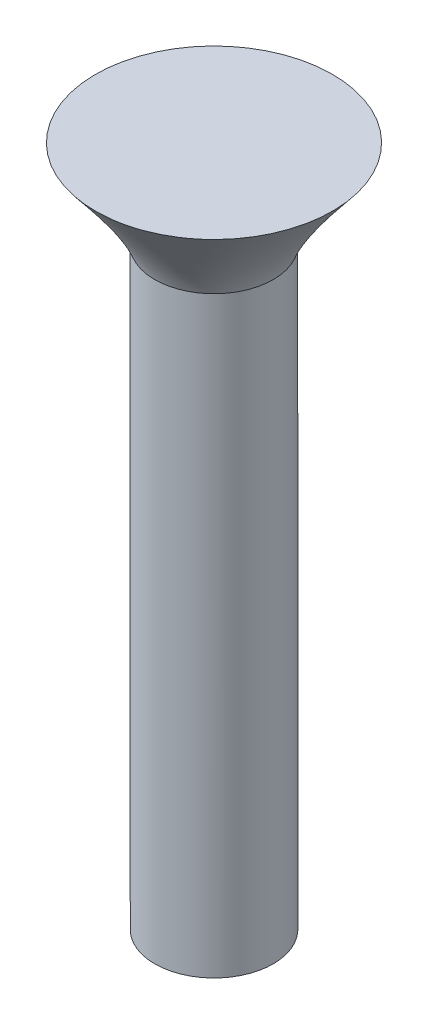
ISO-10303-21;
HEADER;
FILE_DESCRIPTION(('STEP AP214'),'2;1');
FILE_NAME('part.step','',(''),(''),'','','');
FILE_SCHEMA(('AUTOMOTIVE_DESIGN { 1 0 10303 214 1 1 1 1 }'));
ENDSEC;
DATA;
#1=APPLICATION_CONTEXT('core data for automotive mechanical design processes');
#2=APPLICATION_PROTOCOL_DEFINITION('international standard','automotive_design',2000,#1);
#3=PRODUCT_CONTEXT('',#1,'mechanical');
#4=PRODUCT('Part','Part','',(#3));
#5=PRODUCT_RELATED_PRODUCT_CATEGORY('part','',(#4));
#6=PRODUCT_DEFINITION_FORMATION('','',#4);
#7=PRODUCT_DEFINITION_CONTEXT('part definition',#1,'design');
#8=PRODUCT_DEFINITION('design','',#6,#7);
#9=PRODUCT_DEFINITION_SHAPE('','',#8);
#10=(LENGTH_UNIT() NAMED_UNIT(*) SI_UNIT(.MILLI.,.METRE.));
#11=(NAMED_UNIT(*) PLANE_ANGLE_UNIT() SI_UNIT($,.RADIAN.));
#12=(NAMED_UNIT(*) SI_UNIT($,.STERADIAN.) SOLID_ANGLE_UNIT());
#13=UNCERTAINTY_MEASURE_WITH_UNIT(LENGTH_MEASURE(1.E-05),#10,'distance_accuracy_value','');
#14=(GEOMETRIC_REPRESENTATION_CONTEXT(3) GLOBAL_UNCERTAINTY_ASSIGNED_CONTEXT((#13)) GLOBAL_UNIT_ASSIGNED_CONTEXT((#10,
#11,#12)) REPRESENTATION_CONTEXT('',''));
#15=CARTESIAN_POINT('',(0.,0.,0.));
#16=DIRECTION('',(0.,0.,1.));
#17=DIRECTION('',(1.,0.,0.));
#18=AXIS2_PLACEMENT_3D('',#15,#16,#17);
#19=CARTESIAN_POINT('',(0.,20.,0.));
#20=DIRECTION('',(0.,-1.,0.));
#21=DIRECTION('',(0.,0.,-1.));
#22=AXIS2_PLACEMENT_3D('',#19,#20,#21);
#23=CYLINDRICAL_SURFACE('',#22,2.);
#24=CARTESIAN_POINT('',(0.,20.,0.));
#25=DIRECTION('',(0.,-1.,0.));
#26=DIRECTION('',(0.,0.,-1.));
#27=AXIS2_PLACEMENT_3D('',#24,#25,#26);
#28=CIRCLE('',#27,2.);
#29=CARTESIAN_POINT('',(-1.82280655327089,20.,-0.823028717210218));
#30=VERTEX_POINT('',#29);
#31=EDGE_CURVE('E11',#30,#30,#28,.F.);
#32=ORIENTED_EDGE('',*,*,#31,.F.);
#33=EDGE_LOOP('',(#32));
#34=FACE_BOUND('',#33,.T.);
#35=CARTESIAN_POINT('',(0.,0.,0.));
#36=DIRECTION('',(0.,1.,0.));
#37=DIRECTION('',(0.,0.,1.));
#38=AXIS2_PLACEMENT_3D('',#35,#36,#37);
#39=CIRCLE('',#38,2.);
#40=CARTESIAN_POINT('',(0.,0.,2.));
#41=VERTEX_POINT('',#40);
#42=EDGE_CURVE('E45',#41,#41,#39,.T.);
#43=ORIENTED_EDGE('',*,*,#42,.T.);
#44=EDGE_LOOP('',(#43));
#45=FACE_BOUND('',#44,.T.);
#46=ADVANCED_FACE('F38',(#34,#45),#23,.T.);
#47=CARTESIAN_POINT('',(0.,0.,0.));
#48=DIRECTION('',(0.,1.,0.));
#49=DIRECTION('',(0.,0.,1.));
#50=AXIS2_PLACEMENT_3D('',#47,#48,#49);
#51=PLANE('',#50);
#52=ORIENTED_EDGE('',*,*,#42,.F.);
#53=EDGE_LOOP('',(#52));
#54=FACE_BOUND('',#53,.T.);
#55=ADVANCED_FACE('F71',(#54),#51,.F.);
#56=CARTESIAN_POINT('',(0.,23.000000096,0.));
#57=DIRECTION('',(0.,1.,0.));
#58=DIRECTION('',(0.,0.,1.));
#59=AXIS2_PLACEMENT_3D('',#56,#57,#58);
#60=PLANE('',#59);
#61=CARTESIAN_POINT('',(0.,23.000000096,0.));
#62=DIRECTION('',(0.,1.,0.));
#63=DIRECTION('',(0.,0.,1.));
#64=AXIS2_PLACEMENT_3D('',#61,#62,#63);
#65=CIRCLE('',#64,4.);
#66=CARTESIAN_POINT('',(-1.80251306452109,23.000000096,-3.57084676963753));
#67=VERTEX_POINT('',#66);
#68=EDGE_CURVE('E49',#67,#67,#65,.T.);
#69=ORIENTED_EDGE('',*,*,#68,.T.);
#70=EDGE_LOOP('',(#69));
#71=FACE_BOUND('',#70,.T.);
#72=ADVANCED_FACE('F61',(#71),#60,.T.);
#73=CARTESIAN_POINT('',(-1.82280655327089,20.,-0.823028717210218));
#74=CARTESIAN_POINT('',(-1.80251306452109,23.000000096,-3.57084676963753));
#75=CARTESIAN_POINT('',(-3.46886398769133,20.,2.82258438933156));
#76=CARTESIAN_POINT('',(-8.94420660379616,23.000000096,0.0341793594046541));
#77=CARTESIAN_POINT('',(0.176749118850454,20.,4.468641823752));
#78=CARTESIAN_POINT('',(-5.33918047475397,23.000000096,7.17587289867972));
#79=CARTESIAN_POINT('',(1.82280655327089,20.,0.823028717210218));
#80=CARTESIAN_POINT('',(1.80251306452109,23.000000096,3.57084676963753));
#81=CARTESIAN_POINT('',(3.46886398769133,20.,-2.82258438933156));
#82=CARTESIAN_POINT('',(8.94420660379615,23.000000096,-0.0341793594046571));
#83=CARTESIAN_POINT('',(-0.176749118850454,20.,-4.468641823752));
#84=CARTESIAN_POINT('',(5.33918047475396,23.000000096,-7.17587289867972));
#85=CARTESIAN_POINT('',(-1.82280655327089,20.,-0.823028717210218));
#86=CARTESIAN_POINT('',(-1.80251306452109,23.000000096,-3.57084676963753));
#87=(BOUNDED_SURFACE() B_SPLINE_SURFACE(3,1,((#73,#74),(#75,#76),(#77,#78),(#79,#80),(#81,#82),
(#83,#84),(#85,#86)),.UNSPECIFIED.,.T.,.F.,.F.) B_SPLINE_SURFACE_WITH_KNOTS((4,3,4),(2,2),(0.,
0.5,1.),(0.,1.),.UNSPECIFIED.) GEOMETRIC_REPRESENTATION_ITEM() RATIONAL_B_SPLINE_SURFACE(((1.,
1.),(0.333333333333333,0.333333333333333),(0.333333333333333,0.333333333333333),(1.,1.),
(0.333333333333333,0.333333333333333),(0.333333333333333,0.333333333333333),(1.,1.))) REPRESENTATION_ITEM('') SURFACE());
#88=CARTESIAN_POINT('',(-1.82280655327089,20.,-0.823028717210218));
#89=CARTESIAN_POINT('',(-1.82259516276308,20.031250001,-0.851651821923003));
#90=CARTESIAN_POINT('',(-1.82238377225527,20.062500002,-0.880274926635787));
#91=CARTESIAN_POINT('',(-1.82196099123965,20.125000004,-0.937521136061356));
#92=CARTESIAN_POINT('',(-1.82174960073184,20.156250005,-0.966144240774141));
#93=CARTESIAN_POINT('',(-1.82132681971622,20.218750007,-1.02339045019971));
#94=CARTESIAN_POINT('',(-1.82111542920841,20.250000008,-1.05201355491249));
#95=CARTESIAN_POINT('',(-1.82069264819279,20.31250001,-1.10925976433806));
#96=CARTESIAN_POINT('',(-1.82048125768498,20.343750011,-1.13788286905085));
#97=CARTESIAN_POINT('',(-1.82005847666936,20.406250013,-1.19512907847642));
#98=CARTESIAN_POINT('',(-1.81984708616154,20.437500014,-1.2237521831892));
#99=CARTESIAN_POINT('',(-1.81942430514592,20.500000016,-1.28099839261477));
#100=CARTESIAN_POINT('',(-1.81921291463811,20.531250017,-1.30962149732756));
#101=CARTESIAN_POINT('',(-1.81879013362249,20.593750019,-1.36686770675312));
#102=CARTESIAN_POINT('',(-1.81857874311468,20.62500002,-1.39549081146591));
#103=CARTESIAN_POINT('',(-1.81815596209906,20.687500022,-1.45273702089148));
#104=CARTESIAN_POINT('',(-1.81794457159125,20.718750023,-1.48136012560426));
#105=CARTESIAN_POINT('',(-1.81752179057563,20.781250025,-1.53860633502983));
#106=CARTESIAN_POINT('',(-1.81731040006782,20.812500026,-1.56722943974262));
#107=CARTESIAN_POINT('',(-1.8168876190522,20.875000028,-1.62447564916818));
#108=CARTESIAN_POINT('',(-1.81667622854439,20.906250029,-1.65309875388097));
#109=CARTESIAN_POINT('',(-1.81625344752877,20.968750031,-1.71034496330654));
#110=CARTESIAN_POINT('',(-1.81604205702096,21.000000032,-1.73896806801932));
#111=CARTESIAN_POINT('',(-1.81561927600534,21.062500034,-1.79621427744489));
#112=CARTESIAN_POINT('',(-1.81540788549753,21.093750035,-1.82483738215768));
#113=CARTESIAN_POINT('',(-1.81498510448191,21.156250037,-1.88208359158325));
#114=CARTESIAN_POINT('',(-1.8147737139741,21.187500038,-1.91070669629603));
#115=CARTESIAN_POINT('',(-1.81435093295847,21.25000004,-1.9679529057216));
#116=CARTESIAN_POINT('',(-1.81413954245066,21.281250041,-1.99657601043438));
#117=CARTESIAN_POINT('',(-1.81371676143504,21.343750043,-2.05382221985995));
#118=CARTESIAN_POINT('',(-1.81350537092723,21.375000044,-2.08244532457274));
#119=CARTESIAN_POINT('',(-1.81308258991161,21.437500046,-2.13969153399831));
#120=CARTESIAN_POINT('',(-1.8128711994038,21.468750047,-2.16831463871109));
#121=CARTESIAN_POINT('',(-1.81244841838818,21.531250049,-2.22556084813666));
#122=CARTESIAN_POINT('',(-1.81223702788037,21.56250005,-2.25418395284944));
#123=CARTESIAN_POINT('',(-1.81181424686475,21.625000052,-2.31143016227501));
#124=CARTESIAN_POINT('',(-1.81160285635694,21.656250053,-2.3400532669878));
#125=CARTESIAN_POINT('',(-1.81118007534132,21.718750055,-2.39729947641337));
#126=CARTESIAN_POINT('',(-1.81096868483351,21.750000056,-2.42592258112615));
#127=CARTESIAN_POINT('',(-1.81054590381789,21.812500058,-2.48316879055172));
#128=CARTESIAN_POINT('',(-1.81033451331008,21.843750059,-2.5117918952645));
#129=CARTESIAN_POINT('',(-1.80991173229446,21.906250061,-2.56903810469007));
#130=CARTESIAN_POINT('',(-1.80970034178665,21.937500062,-2.59766120940286));
#131=CARTESIAN_POINT('',(-1.80927756077102,22.000000064,-2.65490741882843));
#132=CARTESIAN_POINT('',(-1.80906617026321,22.031250065,-2.68353052354121));
#133=CARTESIAN_POINT('',(-1.80864338924759,22.093750067,-2.74077673296678));
#134=CARTESIAN_POINT('',(-1.80843199873978,22.125000068,-2.76939983767956));
#135=CARTESIAN_POINT('',(-1.80800921772416,22.18750007,-2.82664604710513));
#136=CARTESIAN_POINT('',(-1.80779782721635,22.218750071,-2.85526915181792));
#137=CARTESIAN_POINT('',(-1.80737504620073,22.281250073,-2.91251536124349));
#138=CARTESIAN_POINT('',(-1.80716365569292,22.312500074,-2.94113846595627));
#139=CARTESIAN_POINT('',(-1.8067408746773,22.375000076,-2.99838467538184));
#140=CARTESIAN_POINT('',(-1.80652948416949,22.406250077,-3.02700778009462));
#141=CARTESIAN_POINT('',(-1.80610670315387,22.468750079,-3.08425398952019));
#142=CARTESIAN_POINT('',(-1.80589531264606,22.50000008,-3.11287709423298));
#143=CARTESIAN_POINT('',(-1.80547253163044,22.562500082,-3.17012330365855));
#144=CARTESIAN_POINT('',(-1.80526114112263,22.593750083,-3.19874640837133));
#145=CARTESIAN_POINT('',(-1.80483836010701,22.656250085,-3.2559926177969));
#146=CARTESIAN_POINT('',(-1.8046269695992,22.687500086,-3.28461572250969));
#147=CARTESIAN_POINT('',(-1.80420418858357,22.750000088,-3.34186193193525));
#148=CARTESIAN_POINT('',(-1.80399279807576,22.781250089,-3.37048503664804));
#149=CARTESIAN_POINT('',(-1.80357001706014,22.843750091,-3.42773124607361));
#150=CARTESIAN_POINT('',(-1.80335862655233,22.875000092,-3.45635435078639));
#151=CARTESIAN_POINT('',(-1.80293584553671,22.937500094,-3.51360056021196));
#152=CARTESIAN_POINT('',(-1.8027244550289,22.968750095,-3.54222366492475));
#153=CARTESIAN_POINT('',(-1.80251306452109,23.000000096,-3.57084676963753));
#154=B_SPLINE_CURVE_WITH_KNOTS('',3,(#88,#89,#90,#91,#92,#93,#94,#95,#96,#97,#98,#99,#100,#101,
#102,#103,#104,#105,#106,#107,#108,#109,#110,#111,#112,#113,#114,#115,#116,#117,#118,#119,#120,
#121,#122,#123,#124,#125,#126,#127,#128,#129,#130,#131,#132,#133,#134,#135,#136,#137,#138,#139,
#140,#141,#142,#143,#144,#145,#146,#147,#148,#149,#150,#151,#152,#153),.UNSPECIFIED.,.F.,.F.,(4,
2,2,2,2,2,2,2,2,2,2,2,2,2,2,2,2,2,2,2,2,2,2,2,2,2,2,2,2,2,2,2,4),(0.,0.127133804893161,
0.254267609786322,0.381401414679483,0.508535219572646,0.635669024465807,0.762802829358968,
0.889936634252129,1.01707043914529,1.14420424403845,1.27133804893161,1.39847185382477,
1.52560565871793,1.65273946361109,1.77987326850426,1.90700707339742,2.03414087829058,
2.16127468318374,2.2884084880769,2.41554229297006,2.54267609786322,2.66980990275639,
2.79694370764955,2.92407751254271,3.05121131743587,3.17834512232903,3.30547892722219,
3.43261273211535,3.55974653700851,3.68688034190168,3.81401414679484,3.941147951688,
4.06828175658116),.UNSPECIFIED.);
#155=EDGE_CURVE('BSEAM70',#30,#67,#154,.T.);
#156=ORIENTED_EDGE('',*,*,#31,.T.);
#157=ORIENTED_EDGE('',*,*,#68,.F.);
#158=ORIENTED_EDGE('',*,*,#155,.T.);
#159=ORIENTED_EDGE('',*,*,#155,.F.);
#160=EDGE_LOOP('',(#156,#158,#157,#159));
#161=FACE_BOUND('',#160,.T.);
#162=ADVANCED_FACE('F70',(#161),#87,.T.);
#163=CLOSED_SHELL('',(#46,#55,#72,#162));
#164=MANIFOLD_SOLID_BREP('B2',#163);
#165=ADVANCED_BREP_SHAPE_REPRESENTATION('',(#18,#164),#14);
#166=SHAPE_DEFINITION_REPRESENTATION(#9,#165);
ENDSEC;
END-ISO-10303-21;
